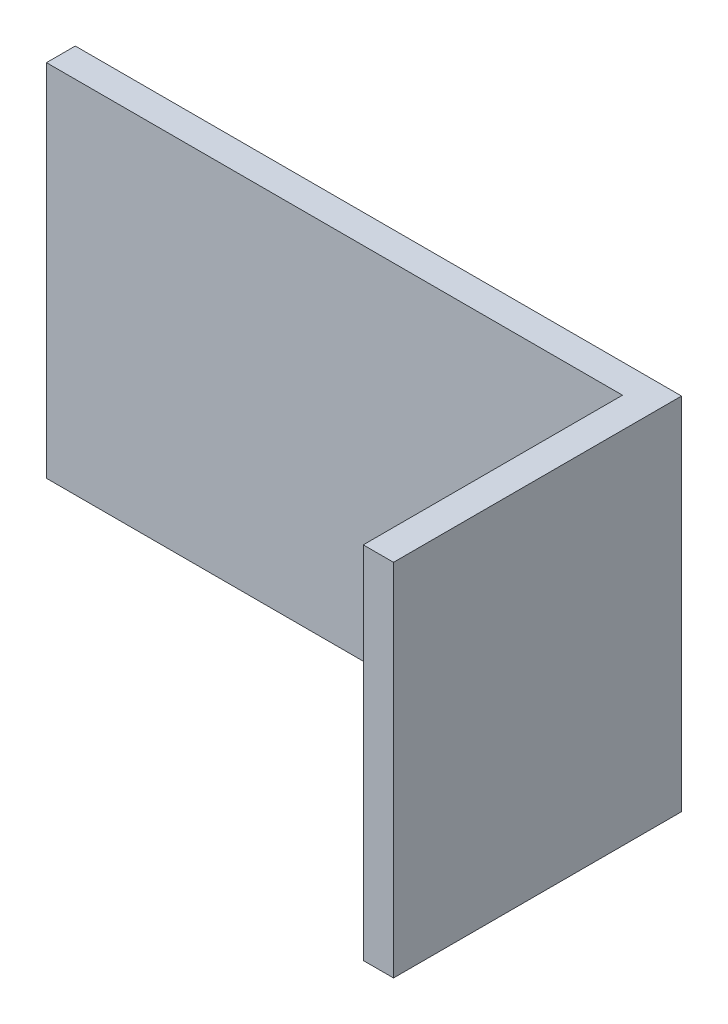
ISO-10303-21;
HEADER;
FILE_DESCRIPTION(('STEP AP214'),'2;1');
FILE_NAME('part.step','',(''),(''),'','','');
FILE_SCHEMA(('AUTOMOTIVE_DESIGN { 1 0 10303 214 1 1 1 1 }'));
ENDSEC;
DATA;
#1=APPLICATION_CONTEXT('core data for automotive mechanical design processes');
#2=APPLICATION_PROTOCOL_DEFINITION('international standard','automotive_design',2000,#1);
#3=PRODUCT_CONTEXT('',#1,'mechanical');
#4=PRODUCT('Part','Part','',(#3));
#5=PRODUCT_RELATED_PRODUCT_CATEGORY('part','',(#4));
#6=PRODUCT_DEFINITION_FORMATION('','',#4);
#7=PRODUCT_DEFINITION_CONTEXT('part definition',#1,'design');
#8=PRODUCT_DEFINITION('design','',#6,#7);
#9=PRODUCT_DEFINITION_SHAPE('','',#8);
#10=(LENGTH_UNIT() NAMED_UNIT(*) SI_UNIT(.MILLI.,.METRE.));
#11=(NAMED_UNIT(*) PLANE_ANGLE_UNIT() SI_UNIT($,.RADIAN.));
#12=(NAMED_UNIT(*) SI_UNIT($,.STERADIAN.) SOLID_ANGLE_UNIT());
#13=UNCERTAINTY_MEASURE_WITH_UNIT(LENGTH_MEASURE(1.E-05),#10,'distance_accuracy_value','');
#14=(GEOMETRIC_REPRESENTATION_CONTEXT(3) GLOBAL_UNCERTAINTY_ASSIGNED_CONTEXT((#13)) GLOBAL_UNIT_ASSIGNED_CONTEXT((#10,
#11,#12)) REPRESENTATION_CONTEXT('',''));
#15=CARTESIAN_POINT('',(0.,0.,0.));
#16=DIRECTION('',(0.,0.,1.));
#17=DIRECTION('',(1.,0.,0.));
#18=AXIS2_PLACEMENT_3D('',#15,#16,#17);
#19=CARTESIAN_POINT('',(1.48217930040456,0.25,0.2));
#20=DIRECTION('',(0.,0.,1.));
#21=DIRECTION('',(1.,0.,0.));
#22=AXIS2_PLACEMENT_3D('',#19,#20,#21);
#23=PLANE('',#22);
#24=DIRECTION('',(0.,-1.,0.));
#25=VECTOR('',#24,1.);
#26=CARTESIAN_POINT('',(1.49267930040456,0.25,0.2));
#27=LINE('',#26,#25);
#28=CARTESIAN_POINT('',(1.49267930040456,0.375,0.2));
#29=VERTEX_POINT('',#28);
#30=CARTESIAN_POINT('',(1.49267930040456,0.125,0.2));
#31=VERTEX_POINT('',#30);
#32=EDGE_CURVE('E97',#29,#31,#27,.T.);
#33=ORIENTED_EDGE('',*,*,#32,.F.);
#34=DIRECTION('',(1.,0.,0.));
#35=VECTOR('',#34,1.);
#36=CARTESIAN_POINT('',(1.34015031489732,0.375,0.2));
#37=LINE('',#36,#35);
#38=CARTESIAN_POINT('',(1.47167930040457,0.375,0.2));
#39=VERTEX_POINT('',#38);
#40=EDGE_CURVE('E74',#39,#29,#37,.T.);
#41=ORIENTED_EDGE('',*,*,#40,.F.);
#42=DIRECTION('',(0.,-1.,0.));
#43=VECTOR('',#42,1.);
#44=CARTESIAN_POINT('',(1.47167930040457,0.25,0.2));
#45=LINE('',#44,#43);
#46=CARTESIAN_POINT('',(1.47167930040457,0.125,0.2));
#47=VERTEX_POINT('',#46);
#48=EDGE_CURVE('E11',#39,#47,#45,.T.);
#49=ORIENTED_EDGE('',*,*,#48,.T.);
#50=DIRECTION('',(1.,0.,0.));
#51=VECTOR('',#50,1.);
#52=CARTESIAN_POINT('',(1.34015031489732,0.125,0.2));
#53=LINE('',#52,#51);
#54=EDGE_CURVE('E71',#47,#31,#53,.T.);
#55=ORIENTED_EDGE('',*,*,#54,.T.);
#56=EDGE_LOOP('',(#33,#41,#49,#55));
#57=FACE_BOUND('',#56,.T.);
#58=ADVANCED_FACE('F17',(#57),#23,.T.);
#59=CARTESIAN_POINT('',(1.27167930040456,0.25,0.02));
#60=DIRECTION('',(0.,0.,1.));
#61=DIRECTION('',(1.,0.,0.));
#62=AXIS2_PLACEMENT_3D('',#59,#60,#61);
#63=PLANE('',#62);
#64=DIRECTION('',(1.,0.,0.));
#65=VECTOR('',#64,1.);
#66=CARTESIAN_POINT('',(1.34015031489732,0.375,0.02));
#67=LINE('',#66,#65);
#68=CARTESIAN_POINT('',(1.07167930040456,0.375,0.02));
#69=VERTEX_POINT('',#68);
#70=CARTESIAN_POINT('',(1.47167930040457,0.375,0.02));
#71=VERTEX_POINT('',#70);
#72=EDGE_CURVE('E115',#69,#71,#67,.T.);
#73=ORIENTED_EDGE('',*,*,#72,.F.);
#74=DIRECTION('',(0.,-1.,0.));
#75=VECTOR('',#74,1.);
#76=CARTESIAN_POINT('',(1.07167930040456,0.25,0.02));
#77=LINE('',#76,#75);
#78=CARTESIAN_POINT('',(1.07167930040456,0.125,0.02));
#79=VERTEX_POINT('',#78);
#80=EDGE_CURVE('E40',#69,#79,#77,.T.);
#81=ORIENTED_EDGE('',*,*,#80,.T.);
#82=DIRECTION('',(1.,0.,0.));
#83=VECTOR('',#82,1.);
#84=CARTESIAN_POINT('',(1.34015031489732,0.125,0.02));
#85=LINE('',#84,#83);
#86=CARTESIAN_POINT('',(1.47167930040457,0.125,0.02));
#87=VERTEX_POINT('',#86);
#88=EDGE_CURVE('E84',#79,#87,#85,.T.);
#89=ORIENTED_EDGE('',*,*,#88,.T.);
#90=DIRECTION('',(0.,1.,0.));
#91=VECTOR('',#90,1.);
#92=CARTESIAN_POINT('',(1.47167930040457,0.25,0.02));
#93=LINE('',#92,#91);
#94=EDGE_CURVE('E27',#87,#71,#93,.T.);
#95=ORIENTED_EDGE('',*,*,#94,.T.);
#96=EDGE_LOOP('',(#73,#81,#89,#95));
#97=FACE_BOUND('',#96,.T.);
#98=ADVANCED_FACE('F19',(#97),#63,.T.);
#99=CARTESIAN_POINT('',(1.47167930040457,0.25,0.11));
#100=DIRECTION('',(1.,0.,0.));
#101=DIRECTION('',(0.,0.,1.));
#102=AXIS2_PLACEMENT_3D('',#99,#100,#101);
#103=PLANE('',#102);
#104=DIRECTION('',(0.,0.,1.));
#105=VECTOR('',#104,1.);
#106=CARTESIAN_POINT('',(1.47167930040457,0.375,0.0420289855072459));
#107=LINE('',#106,#105);
#108=EDGE_CURVE('E121',#71,#39,#107,.T.);
#109=ORIENTED_EDGE('',*,*,#108,.F.);
#110=ORIENTED_EDGE('',*,*,#94,.F.);
#111=DIRECTION('',(0.,0.,1.));
#112=VECTOR('',#111,1.);
#113=CARTESIAN_POINT('',(1.47167930040457,0.125,0.0420289855072459));
#114=LINE('',#113,#112);
#115=EDGE_CURVE('E79',#87,#47,#114,.T.);
#116=ORIENTED_EDGE('',*,*,#115,.T.);
#117=ORIENTED_EDGE('',*,*,#48,.F.);
#118=EDGE_LOOP('',(#109,#110,#116,#117));
#119=FACE_BOUND('',#118,.T.);
#120=ADVANCED_FACE('F80',(#119),#103,.F.);
#121=CARTESIAN_POINT('',(1.07167930040456,0.25,0.01));
#122=DIRECTION('',(1.,0.,0.));
#123=DIRECTION('',(0.,0.,1.));
#124=AXIS2_PLACEMENT_3D('',#121,#122,#123);
#125=PLANE('',#124);
#126=DIRECTION('',(0.,0.,1.));
#127=VECTOR('',#126,1.);
#128=CARTESIAN_POINT('',(1.07167930040456,0.125,0.0420289855072459));
#129=LINE('',#128,#127);
#130=CARTESIAN_POINT('',(1.07167930040456,0.125,0.));
#131=VERTEX_POINT('',#130);
#132=EDGE_CURVE('E103',#131,#79,#129,.T.);
#133=ORIENTED_EDGE('',*,*,#132,.T.);
#134=ORIENTED_EDGE('',*,*,#80,.F.);
#135=DIRECTION('',(0.,0.,1.));
#136=VECTOR('',#135,1.);
#137=CARTESIAN_POINT('',(1.07167930040456,0.375,0.0420289855072459));
#138=LINE('',#137,#136);
#139=CARTESIAN_POINT('',(1.07167930040456,0.375,0.));
#140=VERTEX_POINT('',#139);
#141=EDGE_CURVE('E110',#140,#69,#138,.T.);
#142=ORIENTED_EDGE('',*,*,#141,.F.);
#143=DIRECTION('',(0.,-1.,0.));
#144=VECTOR('',#143,1.);
#145=CARTESIAN_POINT('',(1.07167930040456,0.25,0.));
#146=LINE('',#145,#144);
#147=EDGE_CURVE('E101',#140,#131,#146,.T.);
#148=ORIENTED_EDGE('',*,*,#147,.T.);
#149=EDGE_LOOP('',(#133,#134,#142,#148));
#150=FACE_BOUND('',#149,.T.);
#151=ADVANCED_FACE('F142',(#150),#125,.F.);
#152=CARTESIAN_POINT('',(1.34015031489732,0.125,0.0420289855072459));
#153=DIRECTION('',(0.,1.,0.));
#154=DIRECTION('',(1.,0.,0.));
#155=AXIS2_PLACEMENT_3D('',#152,#153,#154);
#156=PLANE('',#155);
#157=DIRECTION('',(0.,0.,-1.));
#158=VECTOR('',#157,1.);
#159=CARTESIAN_POINT('',(1.49267930040456,0.125,0.0999999999999988));
#160=LINE('',#159,#158);
#161=CARTESIAN_POINT('',(1.49267930040456,0.125,0.));
#162=VERTEX_POINT('',#161);
#163=EDGE_CURVE('E89',#31,#162,#160,.T.);
#164=ORIENTED_EDGE('',*,*,#163,.F.);
#165=ORIENTED_EDGE('',*,*,#54,.F.);
#166=ORIENTED_EDGE('',*,*,#115,.F.);
#167=ORIENTED_EDGE('',*,*,#88,.F.);
#168=ORIENTED_EDGE('',*,*,#132,.F.);
#169=DIRECTION('',(1.,0.,0.));
#170=VECTOR('',#169,1.);
#171=CARTESIAN_POINT('',(1.28217930040456,0.125,0.));
#172=LINE('',#171,#170);
#173=EDGE_CURVE('E146',#131,#162,#172,.T.);
#174=ORIENTED_EDGE('',*,*,#173,.T.);
#175=EDGE_LOOP('',(#164,#165,#166,#167,#168,#174));
#176=FACE_BOUND('',#175,.T.);
#177=ADVANCED_FACE('F86',(#176),#156,.F.);
#178=CARTESIAN_POINT('',(1.49267930040456,0.25,0.0999999999999988));
#179=DIRECTION('',(1.,0.,0.));
#180=DIRECTION('',(0.,0.,-1.));
#181=AXIS2_PLACEMENT_3D('',#178,#179,#180);
#182=PLANE('',#181);
#183=ORIENTED_EDGE('',*,*,#32,.T.);
#184=ORIENTED_EDGE('',*,*,#163,.T.);
#185=DIRECTION('',(0.,1.,0.));
#186=VECTOR('',#185,1.);
#187=CARTESIAN_POINT('',(1.49267930040456,0.25,0.));
#188=LINE('',#187,#186);
#189=CARTESIAN_POINT('',(1.49267930040456,0.375,0.));
#190=VERTEX_POINT('',#189);
#191=EDGE_CURVE('E170',#162,#190,#188,.T.);
#192=ORIENTED_EDGE('',*,*,#191,.T.);
#193=DIRECTION('',(0.,0.,-1.));
#194=VECTOR('',#193,1.);
#195=CARTESIAN_POINT('',(1.49267930040456,0.375,0.0420289855072459));
#196=LINE('',#195,#194);
#197=EDGE_CURVE('E106',#29,#190,#196,.T.);
#198=ORIENTED_EDGE('',*,*,#197,.F.);
#199=EDGE_LOOP('',(#183,#184,#192,#198));
#200=FACE_BOUND('',#199,.T.);
#201=ADVANCED_FACE('F169',(#200),#182,.T.);
#202=CARTESIAN_POINT('',(1.34015031489732,0.375,0.0420289855072459));
#203=DIRECTION('',(0.,1.,0.));
#204=DIRECTION('',(0.,0.,-1.));
#205=AXIS2_PLACEMENT_3D('',#202,#203,#204);
#206=PLANE('',#205);
#207=ORIENTED_EDGE('',*,*,#72,.T.);
#208=ORIENTED_EDGE('',*,*,#108,.T.);
#209=ORIENTED_EDGE('',*,*,#40,.T.);
#210=ORIENTED_EDGE('',*,*,#197,.T.);
#211=DIRECTION('',(-1.,0.,0.));
#212=VECTOR('',#211,1.);
#213=CARTESIAN_POINT('',(1.28217930040456,0.375,0.));
#214=LINE('',#213,#212);
#215=EDGE_CURVE('E111',#190,#140,#214,.T.);
#216=ORIENTED_EDGE('',*,*,#215,.T.);
#217=ORIENTED_EDGE('',*,*,#141,.T.);
#218=EDGE_LOOP('',(#207,#208,#209,#210,#216,#217));
#219=FACE_BOUND('',#218,.T.);
#220=ADVANCED_FACE('F136',(#219),#206,.T.);
#221=CARTESIAN_POINT('',(1.28217930040456,0.25,0.));
#222=DIRECTION('',(0.,0.,1.));
#223=DIRECTION('',(1.,0.,0.));
#224=AXIS2_PLACEMENT_3D('',#221,#222,#223);
#225=PLANE('',#224);
#226=ORIENTED_EDGE('',*,*,#191,.F.);
#227=ORIENTED_EDGE('',*,*,#173,.F.);
#228=ORIENTED_EDGE('',*,*,#147,.F.);
#229=ORIENTED_EDGE('',*,*,#215,.F.);
#230=EDGE_LOOP('',(#226,#227,#228,#229));
#231=FACE_BOUND('',#230,.T.);
#232=ADVANCED_FACE('F260',(#231),#225,.F.);
#233=CLOSED_SHELL('',(#58,#98,#120,#151,#177,#201,#220,#232));
#234=MANIFOLD_SOLID_BREP('B1',#233);
#235=ADVANCED_BREP_SHAPE_REPRESENTATION('',(#18,#234),#14);
#236=SHAPE_DEFINITION_REPRESENTATION(#9,#235);
ENDSEC;
END-ISO-10303-21;
